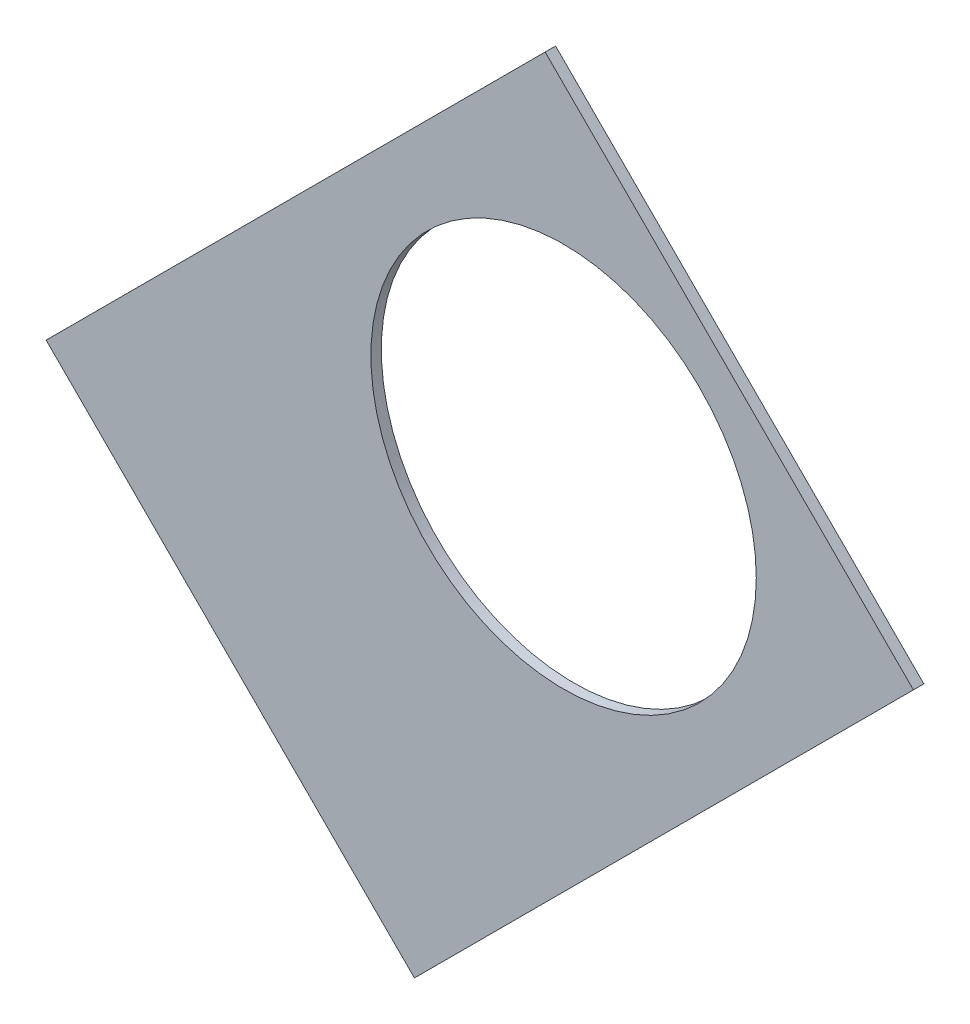
ISO-10303-21;
HEADER;
FILE_DESCRIPTION(('STEP AP214'),'2;1');
FILE_NAME('part.step','',(''),(''),'','','');
FILE_SCHEMA(('AUTOMOTIVE_DESIGN { 1 0 10303 214 1 1 1 1 }'));
ENDSEC;
DATA;
#1=APPLICATION_CONTEXT('core data for automotive mechanical design processes');
#2=APPLICATION_PROTOCOL_DEFINITION('international standard','automotive_design',2000,#1);
#3=PRODUCT_CONTEXT('',#1,'mechanical');
#4=PRODUCT('Part','Part','',(#3));
#5=PRODUCT_RELATED_PRODUCT_CATEGORY('part','',(#4));
#6=PRODUCT_DEFINITION_FORMATION('','',#4);
#7=PRODUCT_DEFINITION_CONTEXT('part definition',#1,'design');
#8=PRODUCT_DEFINITION('design','',#6,#7);
#9=PRODUCT_DEFINITION_SHAPE('','',#8);
#10=(LENGTH_UNIT() NAMED_UNIT(*) SI_UNIT(.MILLI.,.METRE.));
#11=(NAMED_UNIT(*) PLANE_ANGLE_UNIT() SI_UNIT($,.RADIAN.));
#12=(NAMED_UNIT(*) SI_UNIT($,.STERADIAN.) SOLID_ANGLE_UNIT());
#13=UNCERTAINTY_MEASURE_WITH_UNIT(LENGTH_MEASURE(1.E-05),#10,'distance_accuracy_value','');
#14=(GEOMETRIC_REPRESENTATION_CONTEXT(3) GLOBAL_UNCERTAINTY_ASSIGNED_CONTEXT((#13)) GLOBAL_UNIT_ASSIGNED_CONTEXT((#10,
#11,#12)) REPRESENTATION_CONTEXT('',''));
#15=CARTESIAN_POINT('',(0.,0.,0.));
#16=DIRECTION('',(0.,0.,1.));
#17=DIRECTION('',(1.,0.,0.));
#18=AXIS2_PLACEMENT_3D('',#15,#16,#17);
#19=CARTESIAN_POINT('',(0.,0.,0.254));
#20=DIRECTION('',(0.,0.,-1.));
#21=DIRECTION('',(-1.,0.,0.));
#22=AXIS2_PLACEMENT_3D('',#19,#20,#21);
#23=PLANE('',#22);
#24=CARTESIAN_POINT('',(43.644044748396,43.6440447483962,0.254));
#25=DIRECTION('',(0.,0.,1.));
#26=DIRECTION('',(1.,0.,0.));
#27=AXIS2_PLACEMENT_3D('',#24,#25,#26);
#28=CIRCLE('',#27,4.699);
#29=CARTESIAN_POINT('',(48.343044748396,43.6440447483962,0.254));
#30=VERTEX_POINT('',#29);
#31=EDGE_CURVE('E98',#30,#30,#28,.T.);
#32=ORIENTED_EDGE('',*,*,#31,.F.);
#33=EDGE_LOOP('',(#32));
#34=FACE_BOUND('',#33,.T.);
#35=DIRECTION('',(-0.707106781186547,0.707106781186547,0.));
#36=VECTOR('',#35,1.);
#37=CARTESIAN_POINT('',(31.0267848982938,40.0070410193632,0.254));
#38=LINE('',#37,#36);
#39=CARTESIAN_POINT('',(40.007041019363,31.026784898294,0.254));
#40=VERTEX_POINT('',#39);
#41=CARTESIAN_POINT('',(31.0267848982939,40.0070410193632,0.254));
#42=VERTEX_POINT('',#41);
#43=EDGE_CURVE('E50',#40,#42,#38,.T.);
#44=ORIENTED_EDGE('',*,*,#43,.F.);
#45=DIRECTION('',(-0.707106781186546,-0.707106781186549,0.));
#46=VECTOR('',#45,1.);
#47=CARTESIAN_POINT('',(67.191354125102,58.2110980040331,0.254));
#48=LINE('',#47,#46);
#49=CARTESIAN_POINT('',(52.1752880634117,43.1950319423427,0.254));
#50=VERTEX_POINT('',#49);
#51=EDGE_CURVE('E77',#50,#40,#48,.T.);
#52=ORIENTED_EDGE('',*,*,#51,.F.);
#53=DIRECTION('',(0.707106781186548,-0.707106781186548,0.));
#54=VECTOR('',#53,1.);
#55=CARTESIAN_POINT('',(43.1950319423425,52.1752880634119,0.254));
#56=LINE('',#55,#54);
#57=CARTESIAN_POINT('',(43.1950319423425,52.1752880634119,0.254));
#58=VERTEX_POINT('',#57);
#59=EDGE_CURVE('E105',#58,#50,#56,.T.);
#60=ORIENTED_EDGE('',*,*,#59,.F.);
#61=DIRECTION('',(-0.707106781186546,-0.707106781186549,0.));
#62=VECTOR('',#61,1.);
#63=CARTESIAN_POINT('',(67.2114671100052,76.1917232310746,0.254));
#64=LINE('',#63,#62);
#65=EDGE_CURVE('E12',#58,#42,#64,.T.);
#66=ORIENTED_EDGE('',*,*,#65,.T.);
#67=EDGE_LOOP('',(#44,#52,#60,#66));
#68=FACE_BOUND('',#67,.T.);
#69=ADVANCED_FACE('F35',(#34,#68),#23,.F.);
#70=CARTESIAN_POINT('',(0.,0.,0.));
#71=DIRECTION('',(0.,0.,-1.));
#72=DIRECTION('',(-1.,0.,0.));
#73=AXIS2_PLACEMENT_3D('',#70,#71,#72);
#74=PLANE('',#73);
#75=CARTESIAN_POINT('',(43.644044748396,43.6440447483962,0.));
#76=DIRECTION('',(0.,0.,1.));
#77=DIRECTION('',(1.,0.,0.));
#78=AXIS2_PLACEMENT_3D('',#75,#76,#77);
#79=CIRCLE('',#78,4.699);
#80=CARTESIAN_POINT('',(48.343044748396,43.6440447483962,0.));
#81=VERTEX_POINT('',#80);
#82=EDGE_CURVE('E95',#81,#81,#79,.T.);
#83=ORIENTED_EDGE('',*,*,#82,.T.);
#84=EDGE_LOOP('',(#83));
#85=FACE_BOUND('',#84,.T.);
#86=DIRECTION('',(-0.707106781186546,-0.707106781186549,0.));
#87=VECTOR('',#86,1.);
#88=CARTESIAN_POINT('',(67.191354125102,58.2110980040331,0.));
#89=LINE('',#88,#87);
#90=CARTESIAN_POINT('',(52.1752880634117,43.1950319423427,0.));
#91=VERTEX_POINT('',#90);
#92=CARTESIAN_POINT('',(40.007041019363,31.026784898294,0.));
#93=VERTEX_POINT('',#92);
#94=EDGE_CURVE('E92',#91,#93,#89,.T.);
#95=ORIENTED_EDGE('',*,*,#94,.T.);
#96=DIRECTION('',(-0.707106781186547,0.707106781186547,0.));
#97=VECTOR('',#96,1.);
#98=CARTESIAN_POINT('',(31.0267848982938,40.0070410193632,0.));
#99=LINE('',#98,#97);
#100=CARTESIAN_POINT('',(31.0267848982938,40.0070410193632,0.));
#101=VERTEX_POINT('',#100);
#102=EDGE_CURVE('E79',#93,#101,#99,.T.);
#103=ORIENTED_EDGE('',*,*,#102,.T.);
#104=DIRECTION('',(-0.707106781186546,-0.707106781186549,0.));
#105=VECTOR('',#104,1.);
#106=CARTESIAN_POINT('',(67.2114671100052,76.1917232310746,0.));
#107=LINE('',#106,#105);
#108=CARTESIAN_POINT('',(43.1950319423425,52.1752880634118,0.));
#109=VERTEX_POINT('',#108);
#110=EDGE_CURVE('E39',#109,#101,#107,.T.);
#111=ORIENTED_EDGE('',*,*,#110,.F.);
#112=DIRECTION('',(0.707106781186548,-0.707106781186548,0.));
#113=VECTOR('',#112,1.);
#114=CARTESIAN_POINT('',(43.1950319423425,52.1752880634119,0.));
#115=LINE('',#114,#113);
#116=EDGE_CURVE('E58',#109,#91,#115,.T.);
#117=ORIENTED_EDGE('',*,*,#116,.T.);
#118=EDGE_LOOP('',(#95,#103,#111,#117));
#119=FACE_BOUND('',#118,.T.);
#120=ADVANCED_FACE('F113',(#85,#119),#74,.T.);
#121=CARTESIAN_POINT('',(67.191354125102,58.2110980040331,0.254));
#122=DIRECTION('',(0.707106781186549,-0.707106781186546,0.));
#123=DIRECTION('',(0.707106781186546,0.707106781186549,0.));
#124=AXIS2_PLACEMENT_3D('',#121,#122,#123);
#125=PLANE('',#124);
#126=ORIENTED_EDGE('',*,*,#51,.T.);
#127=DIRECTION('',(0.,0.,-1.));
#128=VECTOR('',#127,1.);
#129=CARTESIAN_POINT('',(40.007041019363,31.026784898294,0.254));
#130=LINE('',#129,#128);
#131=EDGE_CURVE('E83',#40,#93,#130,.T.);
#132=ORIENTED_EDGE('',*,*,#131,.T.);
#133=ORIENTED_EDGE('',*,*,#94,.F.);
#134=DIRECTION('',(0.,0.,1.));
#135=VECTOR('',#134,1.);
#136=CARTESIAN_POINT('',(52.1752880634117,43.1950319423427,0.254));
#137=LINE('',#136,#135);
#138=EDGE_CURVE('E80',#91,#50,#137,.T.);
#139=ORIENTED_EDGE('',*,*,#138,.T.);
#140=EDGE_LOOP('',(#126,#132,#133,#139));
#141=FACE_BOUND('',#140,.T.);
#142=ADVANCED_FACE('F91',(#141),#125,.T.);
#143=CARTESIAN_POINT('',(67.2114671100052,76.1917232310746,0.254));
#144=DIRECTION('',(0.707106781186549,-0.707106781186546,0.));
#145=DIRECTION('',(0.707106781186546,0.707106781186549,0.));
#146=AXIS2_PLACEMENT_3D('',#143,#144,#145);
#147=PLANE('',#146);
#148=ORIENTED_EDGE('',*,*,#110,.T.);
#149=DIRECTION('',(0.,0.,1.));
#150=VECTOR('',#149,1.);
#151=CARTESIAN_POINT('',(31.0267848982938,40.0070410193632,0.));
#152=LINE('',#151,#150);
#153=EDGE_CURVE('E107',#101,#42,#152,.T.);
#154=ORIENTED_EDGE('',*,*,#153,.T.);
#155=ORIENTED_EDGE('',*,*,#65,.F.);
#156=DIRECTION('',(0.,0.,1.));
#157=VECTOR('',#156,1.);
#158=CARTESIAN_POINT('',(43.1950319423425,52.1752880634119,0.));
#159=LINE('',#158,#157);
#160=EDGE_CURVE('E101',#109,#58,#159,.T.);
#161=ORIENTED_EDGE('',*,*,#160,.F.);
#162=EDGE_LOOP('',(#148,#154,#155,#161));
#163=FACE_BOUND('',#162,.T.);
#164=ADVANCED_FACE('F37',(#163),#147,.F.);
#165=CARTESIAN_POINT('',(43.644044748396,43.6440447483962,0.));
#166=DIRECTION('',(0.,0.,1.));
#167=DIRECTION('',(1.,0.,0.));
#168=AXIS2_PLACEMENT_3D('',#165,#166,#167);
#169=CYLINDRICAL_SURFACE('',#168,4.699);
#170=ORIENTED_EDGE('',*,*,#82,.F.);
#171=EDGE_LOOP('',(#170));
#172=FACE_BOUND('',#171,.T.);
#173=ORIENTED_EDGE('',*,*,#31,.T.);
#174=EDGE_LOOP('',(#173));
#175=FACE_BOUND('',#174,.T.);
#176=ADVANCED_FACE('F117',(#172,#175),#169,.F.);
#177=CARTESIAN_POINT('',(43.1950319423425,52.1752880634119,0.));
#178=DIRECTION('',(-0.707106781186548,-0.707106781186548,0.));
#179=DIRECTION('',(0.707106781186548,-0.707106781186548,0.));
#180=AXIS2_PLACEMENT_3D('',#177,#178,#179);
#181=PLANE('',#180);
#182=ORIENTED_EDGE('',*,*,#59,.T.);
#183=ORIENTED_EDGE('',*,*,#138,.F.);
#184=ORIENTED_EDGE('',*,*,#116,.F.);
#185=ORIENTED_EDGE('',*,*,#160,.T.);
#186=EDGE_LOOP('',(#182,#183,#184,#185));
#187=FACE_BOUND('',#186,.T.);
#188=ADVANCED_FACE('F115',(#187),#181,.F.);
#189=CARTESIAN_POINT('',(31.0267848982938,40.0070410193632,0.));
#190=DIRECTION('',(0.707106781186548,0.707106781186548,0.));
#191=DIRECTION('',(-0.707106781186548,0.707106781186548,0.));
#192=AXIS2_PLACEMENT_3D('',#189,#190,#191);
#193=PLANE('',#192);
#194=ORIENTED_EDGE('',*,*,#43,.T.);
#195=ORIENTED_EDGE('',*,*,#153,.F.);
#196=ORIENTED_EDGE('',*,*,#102,.F.);
#197=ORIENTED_EDGE('',*,*,#131,.F.);
#198=EDGE_LOOP('',(#194,#195,#196,#197));
#199=FACE_BOUND('',#198,.T.);
#200=ADVANCED_FACE('F84',(#199),#193,.F.);
#201=CLOSED_SHELL('',(#69,#120,#142,#164,#176,#188,#200));
#202=MANIFOLD_SOLID_BREP('B2',#201);
#203=ADVANCED_BREP_SHAPE_REPRESENTATION('',(#18,#202),#14);
#204=SHAPE_DEFINITION_REPRESENTATION(#9,#203);
ENDSEC;
END-ISO-10303-21;
